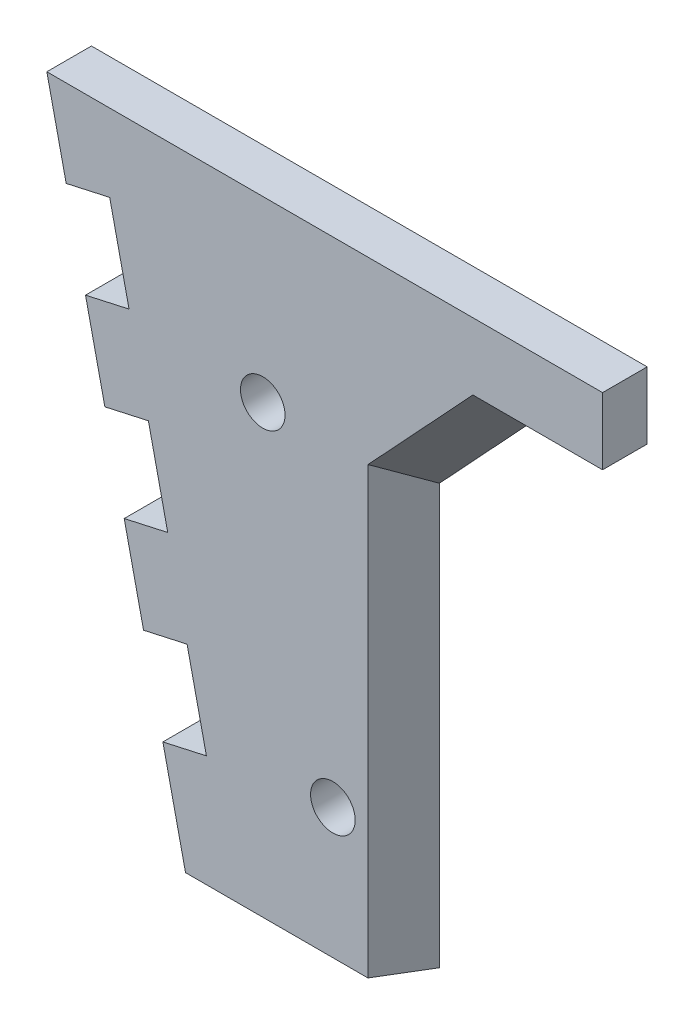
ISO-10303-21;
HEADER;
FILE_DESCRIPTION(('STEP AP214'),'2;1');
FILE_NAME('part.step','',(''),(''),'','','');
FILE_SCHEMA(('AUTOMOTIVE_DESIGN { 1 0 10303 214 1 1 1 1 }'));
ENDSEC;
DATA;
#1=APPLICATION_CONTEXT('core data for automotive mechanical design processes');
#2=APPLICATION_PROTOCOL_DEFINITION('international standard','automotive_design',2000,#1);
#3=PRODUCT_CONTEXT('',#1,'mechanical');
#4=PRODUCT('Part','Part','',(#3));
#5=PRODUCT_RELATED_PRODUCT_CATEGORY('part','',(#4));
#6=PRODUCT_DEFINITION_FORMATION('','',#4);
#7=PRODUCT_DEFINITION_CONTEXT('part definition',#1,'design');
#8=PRODUCT_DEFINITION('design','',#6,#7);
#9=PRODUCT_DEFINITION_SHAPE('','',#8);
#10=(LENGTH_UNIT() NAMED_UNIT(*) SI_UNIT(.MILLI.,.METRE.));
#11=(NAMED_UNIT(*) PLANE_ANGLE_UNIT() SI_UNIT($,.RADIAN.));
#12=(NAMED_UNIT(*) SI_UNIT($,.STERADIAN.) SOLID_ANGLE_UNIT());
#13=UNCERTAINTY_MEASURE_WITH_UNIT(LENGTH_MEASURE(1.E-05),#10,'distance_accuracy_value','');
#14=(GEOMETRIC_REPRESENTATION_CONTEXT(3) GLOBAL_UNCERTAINTY_ASSIGNED_CONTEXT((#13)) GLOBAL_UNIT_ASSIGNED_CONTEXT((#10,
#11,#12)) REPRESENTATION_CONTEXT('',''));
#15=CARTESIAN_POINT('',(0.,0.,0.));
#16=DIRECTION('',(0.,0.,1.));
#17=DIRECTION('',(1.,0.,0.));
#18=AXIS2_PLACEMENT_3D('',#15,#16,#17);
#19=CARTESIAN_POINT('',(29.6276890126643,40.,10.));
#20=DIRECTION('',(0.,0.,1.));
#21=DIRECTION('',(1.,0.,0.));
#22=AXIS2_PLACEMENT_3D('',#19,#20,#21);
#23=PLANE('',#22);
#24=CARTESIAN_POINT('',(15.7228587723433,-70.7745837997296,10.));
#25=DIRECTION('',(0.,0.,-1.));
#26=DIRECTION('',(-1.,0.,0.));
#27=AXIS2_PLACEMENT_3D('',#24,#25,#26);
#28=CIRCLE('',#27,5.);
#29=CARTESIAN_POINT('',(10.7228587723432,-70.7745837997296,10.));
#30=VERTEX_POINT('',#29);
#31=EDGE_CURVE('E189',#30,#30,#28,.T.);
#32=ORIENTED_EDGE('',*,*,#31,.T.);
#33=EDGE_LOOP('',(#32));
#34=FACE_BOUND('',#33,.T.);
#35=DIRECTION('',(-0.681383475206872,-0.73192660814798,0.));
#36=VECTOR('',#35,1.);
#37=CARTESIAN_POINT('',(46.4847398264353,24.3070114716968,10.));
#38=LINE('',#37,#36);
#39=CARTESIAN_POINT('',(47.1298740877629,24.9999999999998,10.));
#40=VERTEX_POINT('',#39);
#41=CARTESIAN_POINT('',(23.5958910043048,-0.279668558527808,10.));
#42=VERTEX_POINT('',#41);
#43=EDGE_CURVE('E210',#40,#42,#38,.T.);
#44=ORIENTED_EDGE('',*,*,#43,.F.);
#45=DIRECTION('',(1.,0.,0.));
#46=VECTOR('',#45,1.);
#47=CARTESIAN_POINT('',(76.2059531896444,24.9999999999999,10.));
#48=LINE('',#47,#46);
#49=CARTESIAN_POINT('',(76.2059531896444,24.9999999999999,10.));
#50=VERTEX_POINT('',#49);
#51=EDGE_CURVE('E188',#40,#50,#48,.T.);
#52=ORIENTED_EDGE('',*,*,#51,.T.);
#53=DIRECTION('',(0.,1.,0.));
#54=VECTOR('',#53,1.);
#55=CARTESIAN_POINT('',(76.2059531896444,-12.712174578499,10.));
#56=LINE('',#55,#54);
#57=CARTESIAN_POINT('',(76.2059531896444,40.,10.));
#58=VERTEX_POINT('',#57);
#59=EDGE_CURVE('E191',#50,#58,#56,.T.);
#60=ORIENTED_EDGE('',*,*,#59,.T.);
#61=DIRECTION('',(-1.,0.,0.));
#62=VECTOR('',#61,1.);
#63=CARTESIAN_POINT('',(-48.4220718002706,40.,10.));
#64=LINE('',#63,#62);
#65=CARTESIAN_POINT('',(-48.4220718002706,40.,10.));
#66=VERTEX_POINT('',#65);
#67=EDGE_CURVE('E175',#58,#66,#64,.T.);
#68=ORIENTED_EDGE('',*,*,#67,.T.);
#69=DIRECTION('',(0.216867017549564,-0.976201155858339,0.));
#70=VECTOR('',#69,1.);
#71=CARTESIAN_POINT('',(-48.4220718002706,40.,10.));
#72=LINE('',#71,#70);
#73=CARTESIAN_POINT('',(-44.0847314492793,20.4759768828332,10.));
#74=VERTEX_POINT('',#73);
#75=EDGE_CURVE('E299',#66,#74,#72,.T.);
#76=ORIENTED_EDGE('',*,*,#75,.T.);
#77=DIRECTION('',(0.976201155858339,0.216867017549564,0.));
#78=VECTOR('',#77,1.);
#79=CARTESIAN_POINT('',(-44.0847314492793,20.4759768828332,10.));
#80=LINE('',#79,#78);
#81=CARTESIAN_POINT('',(-34.322719890696,22.6446470583289,10.));
#82=VERTEX_POINT('',#81);
#83=EDGE_CURVE('E265',#74,#82,#80,.T.);
#84=ORIENTED_EDGE('',*,*,#83,.T.);
#85=DIRECTION('',(0.216867017549564,-0.976201155858339,0.));
#86=VECTOR('',#85,1.);
#87=CARTESIAN_POINT('',(-34.322719890696,22.6446470583289,10.));
#88=LINE('',#87,#86);
#89=CARTESIAN_POINT('',(-29.9853795397047,3.12062394116211,10.));
#90=VERTEX_POINT('',#89);
#91=EDGE_CURVE('E268',#82,#90,#88,.T.);
#92=ORIENTED_EDGE('',*,*,#91,.T.);
#93=DIRECTION('',(-0.976201155858339,-0.216867017549563,0.));
#94=VECTOR('',#93,1.);
#95=CARTESIAN_POINT('',(-39.7473910982881,0.951953765666473,10.));
#96=LINE('',#95,#94);
#97=CARTESIAN_POINT('',(-39.7473910982881,0.951953765666473,10.));
#98=VERTEX_POINT('',#97);
#99=EDGE_CURVE('E272',#90,#98,#96,.T.);
#100=ORIENTED_EDGE('',*,*,#99,.T.);
#101=CARTESIAN_POINT('',(-35.4100507472968,-18.5720693515003,10.));
#102=VERTEX_POINT('',#101);
#103=EDGE_CURVE('E303',#98,#102,#72,.T.);
#104=ORIENTED_EDGE('',*,*,#103,.T.);
#105=DIRECTION('',(0.976201155858339,0.216867017549563,0.));
#106=VECTOR('',#105,1.);
#107=CARTESIAN_POINT('',(-25.6480391887134,-16.4033991760047,10.));
#108=LINE('',#107,#106);
#109=CARTESIAN_POINT('',(-25.6480391887134,-16.4033991760047,10.));
#110=VERTEX_POINT('',#109);
#111=EDGE_CURVE('E246',#102,#110,#108,.T.);
#112=ORIENTED_EDGE('',*,*,#111,.T.);
#113=DIRECTION('',(0.216867017549564,-0.976201155858339,0.));
#114=VECTOR('',#113,1.);
#115=CARTESIAN_POINT('',(-25.6480391887134,-16.4033991760047,10.));
#116=LINE('',#115,#114);
#117=CARTESIAN_POINT('',(-21.3106988377221,-35.9274222931715,10.));
#118=VERTEX_POINT('',#117);
#119=EDGE_CURVE('E239',#110,#118,#116,.T.);
#120=ORIENTED_EDGE('',*,*,#119,.T.);
#121=DIRECTION('',(-0.976201155858339,-0.216867017549564,0.));
#122=VECTOR('',#121,1.);
#123=CARTESIAN_POINT('',(-21.3106988377221,-35.9274222931715,10.));
#124=LINE('',#123,#122);
#125=CARTESIAN_POINT('',(-31.0727103963055,-38.0960924686671,10.));
#126=VERTEX_POINT('',#125);
#127=EDGE_CURVE('E242',#118,#126,#124,.T.);
#128=ORIENTED_EDGE('',*,*,#127,.T.);
#129=CARTESIAN_POINT('',(-26.7353700453142,-57.6201155858339,10.));
#130=VERTEX_POINT('',#129);
#131=EDGE_CURVE('E380',#126,#130,#72,.T.);
#132=ORIENTED_EDGE('',*,*,#131,.T.);
#133=DIRECTION('',(0.976201155858339,0.216867017549564,0.));
#134=VECTOR('',#133,1.);
#135=CARTESIAN_POINT('',(-16.9733584867308,-55.4514454103382,10.));
#136=LINE('',#135,#134);
#137=CARTESIAN_POINT('',(-16.9733584867308,-55.4514454103382,10.));
#138=VERTEX_POINT('',#137);
#139=EDGE_CURVE('E220',#130,#138,#136,.T.);
#140=ORIENTED_EDGE('',*,*,#139,.T.);
#141=DIRECTION('',(0.216867017549564,-0.976201155858339,0.));
#142=VECTOR('',#141,1.);
#143=CARTESIAN_POINT('',(-16.9733584867308,-55.4514454103382,10.));
#144=LINE('',#143,#142);
#145=CARTESIAN_POINT('',(-12.6360181357396,-74.975468527505,10.));
#146=VERTEX_POINT('',#145);
#147=EDGE_CURVE('E213',#138,#146,#144,.T.);
#148=ORIENTED_EDGE('',*,*,#147,.T.);
#149=DIRECTION('',(-0.976201155858339,-0.216867017549563,0.));
#150=VECTOR('',#149,1.);
#151=CARTESIAN_POINT('',(-12.6360181357396,-74.975468527505,10.));
#152=LINE('',#151,#150);
#153=CARTESIAN_POINT('',(-22.398029694323,-77.1441387030007,10.));
#154=VERTEX_POINT('',#153);
#155=EDGE_CURVE('E216',#146,#154,#152,.T.);
#156=ORIENTED_EDGE('',*,*,#155,.T.);
#157=CARTESIAN_POINT('',(-17.3205080756884,-100.,10.));
#158=VERTEX_POINT('',#157);
#159=EDGE_CURVE('E298',#154,#158,#72,.T.);
#160=ORIENTED_EDGE('',*,*,#159,.T.);
#161=DIRECTION('',(1.,0.,0.));
#162=VECTOR('',#161,1.);
#163=CARTESIAN_POINT('',(-17.3205080756884,-100.,10.));
#164=LINE('',#163,#162);
#165=CARTESIAN_POINT('',(23.5958910043048,-100.,10.));
#166=VERTEX_POINT('',#165);
#167=EDGE_CURVE('E302',#158,#166,#164,.T.);
#168=ORIENTED_EDGE('',*,*,#167,.T.);
#169=DIRECTION('',(0.,1.,0.));
#170=VECTOR('',#169,1.);
#171=CARTESIAN_POINT('',(23.5958910043048,-100.,10.));
#172=LINE('',#171,#170);
#173=EDGE_CURVE('E199',#166,#42,#172,.T.);
#174=ORIENTED_EDGE('',*,*,#173,.T.);
#175=EDGE_LOOP('',(#44,#52,#60,#68,#76,#84,#92,#100,#104,#112,#120,#128,#132,#140,#148,#156,
#160,#168,#174));
#176=FACE_BOUND('',#175,.T.);
#177=CARTESIAN_POINT('',(0.,0.,10.));
#178=DIRECTION('',(0.,0.,1.));
#179=DIRECTION('',(1.,0.,0.));
#180=AXIS2_PLACEMENT_3D('',#177,#178,#179);
#181=CIRCLE('',#180,5.);
#182=CARTESIAN_POINT('',(5.,0.,10.));
#183=VERTEX_POINT('',#182);
#184=EDGE_CURVE('E291',#183,#183,#181,.T.);
#185=ORIENTED_EDGE('',*,*,#184,.F.);
#186=EDGE_LOOP('',(#185));
#187=FACE_BOUND('',#186,.T.);
#188=ADVANCED_FACE('F33',(#34,#176,#187),#23,.T.);
#189=CARTESIAN_POINT('',(-17.3205080756884,-100.,10.));
#190=DIRECTION('',(0.,1.,0.));
#191=DIRECTION('',(0.,0.,1.));
#192=AXIS2_PLACEMENT_3D('',#189,#190,#191);
#193=PLANE('',#192);
#194=DIRECTION('',(-0.516496433642572,0.,0.856289340138311));
#195=VECTOR('',#194,1.);
#196=CARTESIAN_POINT('',(29.6276890126643,-100.,0.));
#197=LINE('',#196,#195);
#198=CARTESIAN_POINT('',(29.6276890126643,-100.,0.));
#199=VERTEX_POINT('',#198);
#200=EDGE_CURVE('E204',#199,#166,#197,.T.);
#201=ORIENTED_EDGE('',*,*,#200,.T.);
#202=ORIENTED_EDGE('',*,*,#167,.F.);
#203=DIRECTION('',(0.,0.,-1.));
#204=VECTOR('',#203,1.);
#205=CARTESIAN_POINT('',(-17.3205080756884,-100.,10.));
#206=LINE('',#205,#204);
#207=CARTESIAN_POINT('',(-17.3205080756884,-100.,0.));
#208=VERTEX_POINT('',#207);
#209=EDGE_CURVE('E306',#158,#208,#206,.T.);
#210=ORIENTED_EDGE('',*,*,#209,.T.);
#211=DIRECTION('',(1.,0.,0.));
#212=VECTOR('',#211,1.);
#213=CARTESIAN_POINT('',(-17.3205080756884,-100.,0.));
#214=LINE('',#213,#212);
#215=EDGE_CURVE('E308',#208,#199,#214,.T.);
#216=ORIENTED_EDGE('',*,*,#215,.T.);
#217=EDGE_LOOP('',(#201,#202,#210,#216));
#218=FACE_BOUND('',#217,.T.);
#219=ADVANCED_FACE('F343',(#218),#193,.F.);
#220=CARTESIAN_POINT('',(-48.4220718002706,40.,10.));
#221=DIRECTION('',(0.976201155858339,0.216867017549564,0.));
#222=DIRECTION('',(-0.216867017549564,0.976201155858339,0.));
#223=AXIS2_PLACEMENT_3D('',#220,#221,#222);
#224=PLANE('',#223);
#225=DIRECTION('',(0.216867017549564,-0.976201155858339,0.));
#226=VECTOR('',#225,1.);
#227=CARTESIAN_POINT('',(-48.4220718002706,40.,0.));
#228=LINE('',#227,#226);
#229=CARTESIAN_POINT('',(-31.0727103963055,-38.0960924686671,0.));
#230=VERTEX_POINT('',#229);
#231=CARTESIAN_POINT('',(-26.7353700453142,-57.6201155858339,0.));
#232=VERTEX_POINT('',#231);
#233=EDGE_CURVE('E404',#230,#232,#228,.T.);
#234=ORIENTED_EDGE('',*,*,#233,.T.);
#235=DIRECTION('',(0.,0.,-1.));
#236=VECTOR('',#235,1.);
#237=CARTESIAN_POINT('',(-26.7353700453142,-57.6201155858339,10.));
#238=LINE('',#237,#236);
#239=EDGE_CURVE('E232',#130,#232,#238,.T.);
#240=ORIENTED_EDGE('',*,*,#239,.F.);
#241=ORIENTED_EDGE('',*,*,#131,.F.);
#242=DIRECTION('',(0.,0.,-1.));
#243=VECTOR('',#242,1.);
#244=CARTESIAN_POINT('',(-31.0727103963055,-38.0960924686671,10.));
#245=LINE('',#244,#243);
#246=EDGE_CURVE('E260',#126,#230,#245,.T.);
#247=ORIENTED_EDGE('',*,*,#246,.T.);
#248=EDGE_LOOP('',(#234,#240,#241,#247));
#249=FACE_BOUND('',#248,.T.);
#250=ADVANCED_FACE('F349',(#249),#224,.F.);
#251=CARTESIAN_POINT('',(-39.7473910982881,0.951953765666473,0.));
#252=VERTEX_POINT('',#251);
#253=CARTESIAN_POINT('',(-35.4100507472968,-18.5720693515003,0.));
#254=VERTEX_POINT('',#253);
#255=EDGE_CURVE('E309',#252,#254,#228,.T.);
#256=ORIENTED_EDGE('',*,*,#255,.T.);
#257=DIRECTION('',(0.,0.,-1.));
#258=VECTOR('',#257,1.);
#259=CARTESIAN_POINT('',(-35.4100507472968,-18.5720693515003,10.));
#260=LINE('',#259,#258);
#261=EDGE_CURVE('E258',#102,#254,#260,.T.);
#262=ORIENTED_EDGE('',*,*,#261,.F.);
#263=ORIENTED_EDGE('',*,*,#103,.F.);
#264=DIRECTION('',(0.,0.,-1.));
#265=VECTOR('',#264,1.);
#266=CARTESIAN_POINT('',(-39.7473910982881,0.951953765666473,10.));
#267=LINE('',#266,#265);
#268=EDGE_CURVE('E282',#98,#252,#267,.T.);
#269=ORIENTED_EDGE('',*,*,#268,.T.);
#270=EDGE_LOOP('',(#256,#262,#263,#269));
#271=FACE_BOUND('',#270,.T.);
#272=ADVANCED_FACE('F369',(#271),#224,.F.);
#273=ORIENTED_EDGE('',*,*,#159,.F.);
#274=DIRECTION('',(0.,0.,-1.));
#275=VECTOR('',#274,1.);
#276=CARTESIAN_POINT('',(-22.398029694323,-77.1441387030007,10.));
#277=LINE('',#276,#275);
#278=CARTESIAN_POINT('',(-22.398029694323,-77.1441387030007,0.));
#279=VERTEX_POINT('',#278);
#280=EDGE_CURVE('E234',#154,#279,#277,.T.);
#281=ORIENTED_EDGE('',*,*,#280,.T.);
#282=EDGE_CURVE('E294',#279,#208,#228,.T.);
#283=ORIENTED_EDGE('',*,*,#282,.T.);
#284=ORIENTED_EDGE('',*,*,#209,.F.);
#285=EDGE_LOOP('',(#273,#281,#283,#284));
#286=FACE_BOUND('',#285,.T.);
#287=ADVANCED_FACE('F357',(#286),#224,.F.);
#288=CARTESIAN_POINT('',(29.6276890126643,40.,0.));
#289=DIRECTION('',(0.,0.,1.));
#290=DIRECTION('',(1.,0.,0.));
#291=AXIS2_PLACEMENT_3D('',#288,#289,#290);
#292=PLANE('',#291);
#293=CARTESIAN_POINT('',(15.7228587723433,-70.7745837997296,0.));
#294=DIRECTION('',(0.,0.,-1.));
#295=DIRECTION('',(-1.,0.,0.));
#296=AXIS2_PLACEMENT_3D('',#293,#294,#295);
#297=CIRCLE('',#296,5.);
#298=CARTESIAN_POINT('',(10.7228587723432,-70.7745837997296,0.));
#299=VERTEX_POINT('',#298);
#300=EDGE_CURVE('E194',#299,#299,#297,.T.);
#301=ORIENTED_EDGE('',*,*,#300,.F.);
#302=EDGE_LOOP('',(#301));
#303=FACE_BOUND('',#302,.T.);
#304=DIRECTION('',(-1.,0.,0.));
#305=VECTOR('',#304,1.);
#306=CARTESIAN_POINT('',(72.3533587853273,24.9999999999998,0.));
#307=LINE('',#306,#305);
#308=CARTESIAN_POINT('',(76.2059531896444,24.9999999999998,0.));
#309=VERTEX_POINT('',#308);
#310=CARTESIAN_POINT('',(58.3891825765062,24.9999999999998,0.));
#311=VERTEX_POINT('',#310);
#312=EDGE_CURVE('E184',#309,#311,#307,.T.);
#313=ORIENTED_EDGE('',*,*,#312,.T.);
#314=DIRECTION('',(0.681383475206871,0.731926608147981,0.));
#315=VECTOR('',#314,1.);
#316=CARTESIAN_POINT('',(72.3533587853273,40.,0.));
#317=LINE('',#316,#315);
#318=CARTESIAN_POINT('',(29.6276890126643,-5.89494124151099,0.));
#319=VERTEX_POINT('',#318);
#320=EDGE_CURVE('E47',#319,#311,#317,.T.);
#321=ORIENTED_EDGE('',*,*,#320,.F.);
#322=DIRECTION('',(0.,1.,0.));
#323=VECTOR('',#322,1.);
#324=CARTESIAN_POINT('',(29.6276890126643,-100.,0.));
#325=LINE('',#324,#323);
#326=EDGE_CURVE('E312',#199,#319,#325,.T.);
#327=ORIENTED_EDGE('',*,*,#326,.F.);
#328=ORIENTED_EDGE('',*,*,#215,.F.);
#329=ORIENTED_EDGE('',*,*,#282,.F.);
#330=DIRECTION('',(-0.976201155858339,-0.216867017549563,0.));
#331=VECTOR('',#330,1.);
#332=CARTESIAN_POINT('',(-12.6360181357396,-74.975468527505,0.));
#333=LINE('',#332,#331);
#334=CARTESIAN_POINT('',(-12.6360181357396,-74.975468527505,0.));
#335=VERTEX_POINT('',#334);
#336=EDGE_CURVE('E225',#335,#279,#333,.T.);
#337=ORIENTED_EDGE('',*,*,#336,.F.);
#338=DIRECTION('',(0.216867017549564,-0.976201155858339,0.));
#339=VECTOR('',#338,1.);
#340=CARTESIAN_POINT('',(-16.9733584867308,-55.4514454103382,0.));
#341=LINE('',#340,#339);
#342=CARTESIAN_POINT('',(-16.9733584867308,-55.4514454103382,0.));
#343=VERTEX_POINT('',#342);
#344=EDGE_CURVE('E212',#343,#335,#341,.T.);
#345=ORIENTED_EDGE('',*,*,#344,.F.);
#346=DIRECTION('',(0.976201155858339,0.216867017549564,0.));
#347=VECTOR('',#346,1.);
#348=CARTESIAN_POINT('',(-16.9733584867308,-55.4514454103382,0.));
#349=LINE('',#348,#347);
#350=EDGE_CURVE('E217',#232,#343,#349,.T.);
#351=ORIENTED_EDGE('',*,*,#350,.F.);
#352=ORIENTED_EDGE('',*,*,#233,.F.);
#353=DIRECTION('',(-0.976201155858339,-0.216867017549564,0.));
#354=VECTOR('',#353,1.);
#355=CARTESIAN_POINT('',(-21.3106988377221,-35.9274222931715,0.));
#356=LINE('',#355,#354);
#357=CARTESIAN_POINT('',(-21.3106988377221,-35.9274222931714,0.));
#358=VERTEX_POINT('',#357);
#359=EDGE_CURVE('E251',#358,#230,#356,.T.);
#360=ORIENTED_EDGE('',*,*,#359,.F.);
#361=DIRECTION('',(0.216867017549564,-0.976201155858339,0.));
#362=VECTOR('',#361,1.);
#363=CARTESIAN_POINT('',(-25.6480391887134,-16.4033991760047,0.));
#364=LINE('',#363,#362);
#365=CARTESIAN_POINT('',(-25.6480391887134,-16.4033991760047,0.));
#366=VERTEX_POINT('',#365);
#367=EDGE_CURVE('E231',#366,#358,#364,.T.);
#368=ORIENTED_EDGE('',*,*,#367,.F.);
#369=DIRECTION('',(0.976201155858339,0.216867017549563,0.));
#370=VECTOR('',#369,1.);
#371=CARTESIAN_POINT('',(-25.6480391887134,-16.4033991760047,0.));
#372=LINE('',#371,#370);
#373=EDGE_CURVE('E243',#254,#366,#372,.T.);
#374=ORIENTED_EDGE('',*,*,#373,.F.);
#375=ORIENTED_EDGE('',*,*,#255,.F.);
#376=DIRECTION('',(-0.976201155858339,-0.216867017549563,0.));
#377=VECTOR('',#376,1.);
#378=CARTESIAN_POINT('',(-39.7473910982881,0.951953765666473,0.));
#379=LINE('',#378,#377);
#380=CARTESIAN_POINT('',(-29.9853795397047,3.12062394116211,0.));
#381=VERTEX_POINT('',#380);
#382=EDGE_CURVE('E269',#381,#252,#379,.T.);
#383=ORIENTED_EDGE('',*,*,#382,.F.);
#384=DIRECTION('',(0.216867017549564,-0.976201155858339,0.));
#385=VECTOR('',#384,1.);
#386=CARTESIAN_POINT('',(-34.322719890696,22.6446470583289,0.));
#387=LINE('',#386,#385);
#388=CARTESIAN_POINT('',(-34.322719890696,22.6446470583289,0.));
#389=VERTEX_POINT('',#388);
#390=EDGE_CURVE('E278',#389,#381,#387,.T.);
#391=ORIENTED_EDGE('',*,*,#390,.F.);
#392=DIRECTION('',(0.976201155858339,0.216867017549564,0.));
#393=VECTOR('',#392,1.);
#394=CARTESIAN_POINT('',(-44.0847314492793,20.4759768828332,0.));
#395=LINE('',#394,#393);
#396=CARTESIAN_POINT('',(-44.0847314492793,20.4759768828332,0.));
#397=VERTEX_POINT('',#396);
#398=EDGE_CURVE('E257',#397,#389,#395,.T.);
#399=ORIENTED_EDGE('',*,*,#398,.F.);
#400=CARTESIAN_POINT('',(-48.4220718002706,40.,0.));
#401=VERTEX_POINT('',#400);
#402=EDGE_CURVE('E170',#401,#397,#228,.T.);
#403=ORIENTED_EDGE('',*,*,#402,.F.);
#404=DIRECTION('',(-1.,0.,0.));
#405=VECTOR('',#404,1.);
#406=CARTESIAN_POINT('',(72.3533587853273,40.,0.));
#407=LINE('',#406,#405);
#408=CARTESIAN_POINT('',(76.2059531896444,40.,0.));
#409=VERTEX_POINT('',#408);
#410=EDGE_CURVE('E161',#409,#401,#407,.T.);
#411=ORIENTED_EDGE('',*,*,#410,.F.);
#412=DIRECTION('',(0.,1.,0.));
#413=VECTOR('',#412,1.);
#414=CARTESIAN_POINT('',(76.2059531896444,-12.712174578499,0.));
#415=LINE('',#414,#413);
#416=EDGE_CURVE('E166',#309,#409,#415,.T.);
#417=ORIENTED_EDGE('',*,*,#416,.F.);
#418=EDGE_LOOP('',(#313,#321,#327,#328,#329,#337,#345,#351,#352,#360,#368,#374,#375,#383,#391,
#399,#403,#411,#417));
#419=FACE_BOUND('',#418,.T.);
#420=CARTESIAN_POINT('',(0.,0.,0.));
#421=DIRECTION('',(0.,0.,1.));
#422=DIRECTION('',(1.,0.,0.));
#423=AXIS2_PLACEMENT_3D('',#420,#421,#422);
#424=CIRCLE('',#423,5.);
#425=CARTESIAN_POINT('',(5.,0.,0.));
#426=VERTEX_POINT('',#425);
#427=EDGE_CURVE('E285',#426,#426,#424,.T.);
#428=ORIENTED_EDGE('',*,*,#427,.T.);
#429=EDGE_LOOP('',(#428));
#430=FACE_BOUND('',#429,.T.);
#431=ADVANCED_FACE('F164',(#303,#419,#430),#292,.F.);
#432=ORIENTED_EDGE('',*,*,#402,.T.);
#433=DIRECTION('',(0.,0.,-1.));
#434=VECTOR('',#433,1.);
#435=CARTESIAN_POINT('',(-44.0847314492793,20.4759768828332,10.));
#436=LINE('',#435,#434);
#437=EDGE_CURVE('E275',#74,#397,#436,.T.);
#438=ORIENTED_EDGE('',*,*,#437,.F.);
#439=ORIENTED_EDGE('',*,*,#75,.F.);
#440=DIRECTION('',(0.,0.,-1.));
#441=VECTOR('',#440,1.);
#442=CARTESIAN_POINT('',(-48.4220718002706,40.,10.));
#443=LINE('',#442,#441);
#444=EDGE_CURVE('E41',#66,#401,#443,.T.);
#445=ORIENTED_EDGE('',*,*,#444,.T.);
#446=EDGE_LOOP('',(#432,#438,#439,#445));
#447=FACE_BOUND('',#446,.T.);
#448=ADVANCED_FACE('F35',(#447),#224,.F.);
#449=CARTESIAN_POINT('',(72.3533587853273,40.,10.));
#450=DIRECTION('',(0.,-1.,0.));
#451=DIRECTION('',(1.,0.,0.));
#452=AXIS2_PLACEMENT_3D('',#449,#450,#451);
#453=PLANE('',#452);
#454=ORIENTED_EDGE('',*,*,#444,.F.);
#455=ORIENTED_EDGE('',*,*,#67,.F.);
#456=DIRECTION('',(0.,0.,-1.));
#457=VECTOR('',#456,1.);
#458=CARTESIAN_POINT('',(76.2059531896444,40.,0.));
#459=LINE('',#458,#457);
#460=EDGE_CURVE('E181',#58,#409,#459,.T.);
#461=ORIENTED_EDGE('',*,*,#460,.T.);
#462=ORIENTED_EDGE('',*,*,#410,.T.);
#463=EDGE_LOOP('',(#454,#455,#461,#462));
#464=FACE_BOUND('',#463,.T.);
#465=ADVANCED_FACE('F186',(#464),#453,.F.);
#466=CARTESIAN_POINT('',(0.,0.,10.));
#467=DIRECTION('',(0.,0.,-1.));
#468=DIRECTION('',(-1.,0.,0.));
#469=AXIS2_PLACEMENT_3D('',#466,#467,#468);
#470=CYLINDRICAL_SURFACE('',#469,5.);
#471=ORIENTED_EDGE('',*,*,#184,.T.);
#472=EDGE_LOOP('',(#471));
#473=FACE_BOUND('',#472,.T.);
#474=ORIENTED_EDGE('',*,*,#427,.F.);
#475=EDGE_LOOP('',(#474));
#476=FACE_BOUND('',#475,.T.);
#477=ADVANCED_FACE('F353',(#473,#476),#470,.F.);
#478=CARTESIAN_POINT('',(-39.7473910982881,0.951953765666473,10.));
#479=DIRECTION('',(0.216867017549563,-0.976201155858339,0.));
#480=DIRECTION('',(0.976201155858339,0.216867017549563,0.));
#481=AXIS2_PLACEMENT_3D('',#478,#479,#480);
#482=PLANE('',#481);
#483=ORIENTED_EDGE('',*,*,#382,.T.);
#484=ORIENTED_EDGE('',*,*,#268,.F.);
#485=ORIENTED_EDGE('',*,*,#99,.F.);
#486=DIRECTION('',(0.,0.,-1.));
#487=VECTOR('',#486,1.);
#488=CARTESIAN_POINT('',(-29.9853795397047,3.12062394116211,10.));
#489=LINE('',#488,#487);
#490=EDGE_CURVE('E286',#90,#381,#489,.T.);
#491=ORIENTED_EDGE('',*,*,#490,.T.);
#492=EDGE_LOOP('',(#483,#484,#485,#491));
#493=FACE_BOUND('',#492,.T.);
#494=ADVANCED_FACE('F364',(#493),#482,.F.);
#495=CARTESIAN_POINT('',(-34.322719890696,22.6446470583289,10.));
#496=DIRECTION('',(0.976201155858339,0.216867017549564,0.));
#497=DIRECTION('',(-0.216867017549564,0.976201155858339,0.));
#498=AXIS2_PLACEMENT_3D('',#495,#496,#497);
#499=PLANE('',#498);
#500=ORIENTED_EDGE('',*,*,#390,.T.);
#501=ORIENTED_EDGE('',*,*,#490,.F.);
#502=ORIENTED_EDGE('',*,*,#91,.F.);
#503=DIRECTION('',(0.,0.,-1.));
#504=VECTOR('',#503,1.);
#505=CARTESIAN_POINT('',(-34.322719890696,22.6446470583289,10.));
#506=LINE('',#505,#504);
#507=EDGE_CURVE('E288',#82,#389,#506,.T.);
#508=ORIENTED_EDGE('',*,*,#507,.T.);
#509=EDGE_LOOP('',(#500,#501,#502,#508));
#510=FACE_BOUND('',#509,.T.);
#511=ADVANCED_FACE('F428',(#510),#499,.F.);
#512=CARTESIAN_POINT('',(-44.0847314492793,20.4759768828332,10.));
#513=DIRECTION('',(-0.216867017549564,0.976201155858339,0.));
#514=DIRECTION('',(-0.976201155858339,-0.216867017549564,0.));
#515=AXIS2_PLACEMENT_3D('',#512,#513,#514);
#516=PLANE('',#515);
#517=ORIENTED_EDGE('',*,*,#398,.T.);
#518=ORIENTED_EDGE('',*,*,#507,.F.);
#519=ORIENTED_EDGE('',*,*,#83,.F.);
#520=ORIENTED_EDGE('',*,*,#437,.T.);
#521=EDGE_LOOP('',(#517,#518,#519,#520));
#522=FACE_BOUND('',#521,.T.);
#523=ADVANCED_FACE('F425',(#522),#516,.F.);
#524=CARTESIAN_POINT('',(-25.6480391887134,-16.4033991760047,10.));
#525=DIRECTION('',(0.976201155858339,0.216867017549564,0.));
#526=DIRECTION('',(-0.216867017549564,0.976201155858339,0.));
#527=AXIS2_PLACEMENT_3D('',#524,#525,#526);
#528=PLANE('',#527);
#529=ORIENTED_EDGE('',*,*,#367,.T.);
#530=DIRECTION('',(0.,0.,-1.));
#531=VECTOR('',#530,1.);
#532=CARTESIAN_POINT('',(-21.3106988377221,-35.9274222931715,10.));
#533=LINE('',#532,#531);
#534=EDGE_CURVE('E249',#118,#358,#533,.T.);
#535=ORIENTED_EDGE('',*,*,#534,.F.);
#536=ORIENTED_EDGE('',*,*,#119,.F.);
#537=DIRECTION('',(0.,0.,-1.));
#538=VECTOR('',#537,1.);
#539=CARTESIAN_POINT('',(-25.6480391887134,-16.4033991760047,10.));
#540=LINE('',#539,#538);
#541=EDGE_CURVE('E255',#110,#366,#540,.T.);
#542=ORIENTED_EDGE('',*,*,#541,.T.);
#543=EDGE_LOOP('',(#529,#535,#536,#542));
#544=FACE_BOUND('',#543,.T.);
#545=ADVANCED_FACE('F397',(#544),#528,.F.);
#546=CARTESIAN_POINT('',(-25.6480391887134,-16.4033991760047,10.));
#547=DIRECTION('',(-0.216867017549563,0.976201155858339,0.));
#548=DIRECTION('',(-0.976201155858339,-0.216867017549563,0.));
#549=AXIS2_PLACEMENT_3D('',#546,#547,#548);
#550=PLANE('',#549);
#551=ORIENTED_EDGE('',*,*,#373,.T.);
#552=ORIENTED_EDGE('',*,*,#541,.F.);
#553=ORIENTED_EDGE('',*,*,#111,.F.);
#554=ORIENTED_EDGE('',*,*,#261,.T.);
#555=EDGE_LOOP('',(#551,#552,#553,#554));
#556=FACE_BOUND('',#555,.T.);
#557=ADVANCED_FACE('F391',(#556),#550,.F.);
#558=CARTESIAN_POINT('',(-21.3106988377221,-35.9274222931715,10.));
#559=DIRECTION('',(0.216867017549564,-0.976201155858339,0.));
#560=DIRECTION('',(0.976201155858339,0.216867017549564,0.));
#561=AXIS2_PLACEMENT_3D('',#558,#559,#560);
#562=PLANE('',#561);
#563=ORIENTED_EDGE('',*,*,#359,.T.);
#564=ORIENTED_EDGE('',*,*,#246,.F.);
#565=ORIENTED_EDGE('',*,*,#127,.F.);
#566=ORIENTED_EDGE('',*,*,#534,.T.);
#567=EDGE_LOOP('',(#563,#564,#565,#566));
#568=FACE_BOUND('',#567,.T.);
#569=ADVANCED_FACE('F401',(#568),#562,.F.);
#570=CARTESIAN_POINT('',(-16.9733584867308,-55.4514454103382,10.));
#571=DIRECTION('',(0.976201155858339,0.216867017549564,0.));
#572=DIRECTION('',(-0.216867017549564,0.976201155858339,0.));
#573=AXIS2_PLACEMENT_3D('',#570,#571,#572);
#574=PLANE('',#573);
#575=ORIENTED_EDGE('',*,*,#344,.T.);
#576=DIRECTION('',(0.,0.,-1.));
#577=VECTOR('',#576,1.);
#578=CARTESIAN_POINT('',(-12.6360181357396,-74.975468527505,10.));
#579=LINE('',#578,#577);
#580=EDGE_CURVE('E223',#146,#335,#579,.T.);
#581=ORIENTED_EDGE('',*,*,#580,.F.);
#582=ORIENTED_EDGE('',*,*,#147,.F.);
#583=DIRECTION('',(0.,0.,-1.));
#584=VECTOR('',#583,1.);
#585=CARTESIAN_POINT('',(-16.9733584867308,-55.4514454103382,10.));
#586=LINE('',#585,#584);
#587=EDGE_CURVE('E229',#138,#343,#586,.T.);
#588=ORIENTED_EDGE('',*,*,#587,.T.);
#589=EDGE_LOOP('',(#575,#581,#582,#588));
#590=FACE_BOUND('',#589,.T.);
#591=ADVANCED_FACE('F410',(#590),#574,.F.);
#592=CARTESIAN_POINT('',(-16.9733584867308,-55.4514454103382,10.));
#593=DIRECTION('',(-0.216867017549564,0.976201155858339,0.));
#594=DIRECTION('',(-0.976201155858339,-0.216867017549564,0.));
#595=AXIS2_PLACEMENT_3D('',#592,#593,#594);
#596=PLANE('',#595);
#597=ORIENTED_EDGE('',*,*,#350,.T.);
#598=ORIENTED_EDGE('',*,*,#587,.F.);
#599=ORIENTED_EDGE('',*,*,#139,.F.);
#600=ORIENTED_EDGE('',*,*,#239,.T.);
#601=EDGE_LOOP('',(#597,#598,#599,#600));
#602=FACE_BOUND('',#601,.T.);
#603=ADVANCED_FACE('F338',(#602),#596,.F.);
#604=CARTESIAN_POINT('',(-12.6360181357396,-74.975468527505,10.));
#605=DIRECTION('',(0.216867017549563,-0.976201155858339,0.));
#606=DIRECTION('',(0.976201155858339,0.216867017549563,0.));
#607=AXIS2_PLACEMENT_3D('',#604,#605,#606);
#608=PLANE('',#607);
#609=ORIENTED_EDGE('',*,*,#336,.T.);
#610=ORIENTED_EDGE('',*,*,#280,.F.);
#611=ORIENTED_EDGE('',*,*,#155,.F.);
#612=ORIENTED_EDGE('',*,*,#580,.T.);
#613=EDGE_LOOP('',(#609,#610,#611,#612));
#614=FACE_BOUND('',#613,.T.);
#615=ADVANCED_FACE('F331',(#614),#608,.F.);
#616=CARTESIAN_POINT('',(29.6276890126643,-5.89494124151097,0.));
#617=DIRECTION('',(-0.564838439065765,0.525833566175316,-0.635969023174163));
#618=DIRECTION('',(-0.747682088351076,0.,0.664056846029745));
#619=AXIS2_PLACEMENT_3D('',#616,#617,#618);
#620=PLANE('',#619);
#621=ORIENTED_EDGE('',*,*,#320,.T.);
#622=DIRECTION('',(-0.747682088351076,0.,0.664056846029746));
#623=VECTOR('',#622,1.);
#624=CARTESIAN_POINT('',(42.3106878210123,24.9999999999999,14.2801796145552));
#625=LINE('',#624,#623);
#626=EDGE_CURVE('E11',#311,#40,#625,.T.);
#627=ORIENTED_EDGE('',*,*,#626,.T.);
#628=ORIENTED_EDGE('',*,*,#43,.T.);
#629=DIRECTION('',(-0.465482650019049,0.433338783134331,0.771714585557964));
#630=VECTOR('',#629,1.);
#631=CARTESIAN_POINT('',(26.0354915092256,-2.55080264718396,5.95543401562897));
#632=LINE('',#631,#630);
#633=EDGE_CURVE('E207',#319,#42,#632,.T.);
#634=ORIENTED_EDGE('',*,*,#633,.F.);
#635=EDGE_LOOP('',(#621,#627,#628,#634));
#636=FACE_BOUND('',#635,.T.);
#637=ADVANCED_FACE('F329',(#636),#620,.F.);
#638=CARTESIAN_POINT('',(23.5958910043048,-100.,10.));
#639=DIRECTION('',(0.856289340138311,0.,0.516496433642572));
#640=DIRECTION('',(0.516496433642572,0.,-0.856289340138311));
#641=AXIS2_PLACEMENT_3D('',#638,#639,#640);
#642=PLANE('',#641);
#643=ORIENTED_EDGE('',*,*,#173,.F.);
#644=ORIENTED_EDGE('',*,*,#200,.F.);
#645=ORIENTED_EDGE('',*,*,#326,.T.);
#646=ORIENTED_EDGE('',*,*,#633,.T.);
#647=EDGE_LOOP('',(#643,#644,#645,#646));
#648=FACE_BOUND('',#647,.T.);
#649=ADVANCED_FACE('F328',(#648),#642,.T.);
#650=CARTESIAN_POINT('',(47.483102356378,24.9999999999998,10.));
#651=DIRECTION('',(0.,-1.,0.));
#652=DIRECTION('',(-0.641027117987986,0.,-0.767518230404996));
#653=AXIS2_PLACEMENT_3D('',#650,#651,#652);
#654=PLANE('',#653);
#655=ORIENTED_EDGE('',*,*,#626,.F.);
#656=ORIENTED_EDGE('',*,*,#312,.F.);
#657=DIRECTION('',(0.,0.,-1.));
#658=VECTOR('',#657,1.);
#659=CARTESIAN_POINT('',(76.2059531896444,24.9999999999998,0.));
#660=LINE('',#659,#658);
#661=EDGE_CURVE('E183',#50,#309,#660,.T.);
#662=ORIENTED_EDGE('',*,*,#661,.F.);
#663=ORIENTED_EDGE('',*,*,#51,.F.);
#664=EDGE_LOOP('',(#655,#656,#662,#663));
#665=FACE_BOUND('',#664,.T.);
#666=ADVANCED_FACE('F323',(#665),#654,.T.);
#667=CARTESIAN_POINT('',(76.2059531896444,-12.712174578499,0.));
#668=DIRECTION('',(1.,0.,0.));
#669=DIRECTION('',(0.,1.,0.));
#670=AXIS2_PLACEMENT_3D('',#667,#668,#669);
#671=PLANE('',#670);
#672=ORIENTED_EDGE('',*,*,#59,.F.);
#673=ORIENTED_EDGE('',*,*,#661,.T.);
#674=ORIENTED_EDGE('',*,*,#416,.T.);
#675=ORIENTED_EDGE('',*,*,#460,.F.);
#676=EDGE_LOOP('',(#672,#673,#674,#675));
#677=FACE_BOUND('',#676,.T.);
#678=ADVANCED_FACE('F180',(#677),#671,.T.);
#679=CARTESIAN_POINT('',(15.7228587723433,-70.7745837997296,10.));
#680=DIRECTION('',(0.,0.,-1.));
#681=DIRECTION('',(-1.,0.,0.));
#682=AXIS2_PLACEMENT_3D('',#679,#680,#681);
#683=CYLINDRICAL_SURFACE('',#682,5.);
#684=ORIENTED_EDGE('',*,*,#31,.F.);
#685=EDGE_LOOP('',(#684));
#686=FACE_BOUND('',#685,.T.);
#687=ORIENTED_EDGE('',*,*,#300,.T.);
#688=EDGE_LOOP('',(#687));
#689=FACE_BOUND('',#688,.T.);
#690=ADVANCED_FACE('F508',(#686,#689),#683,.F.);
#691=CLOSED_SHELL('',(#188,#219,#250,#272,#287,#431,#448,#465,#477,#494,#511,#523,#545,#557,
#569,#591,#603,#615,#637,#649,#666,#678,#690));
#692=MANIFOLD_SOLID_BREP('B2',#691);
#693=ADVANCED_BREP_SHAPE_REPRESENTATION('',(#18,#692),#14);
#694=SHAPE_DEFINITION_REPRESENTATION(#9,#693);
ENDSEC;
END-ISO-10303-21;
